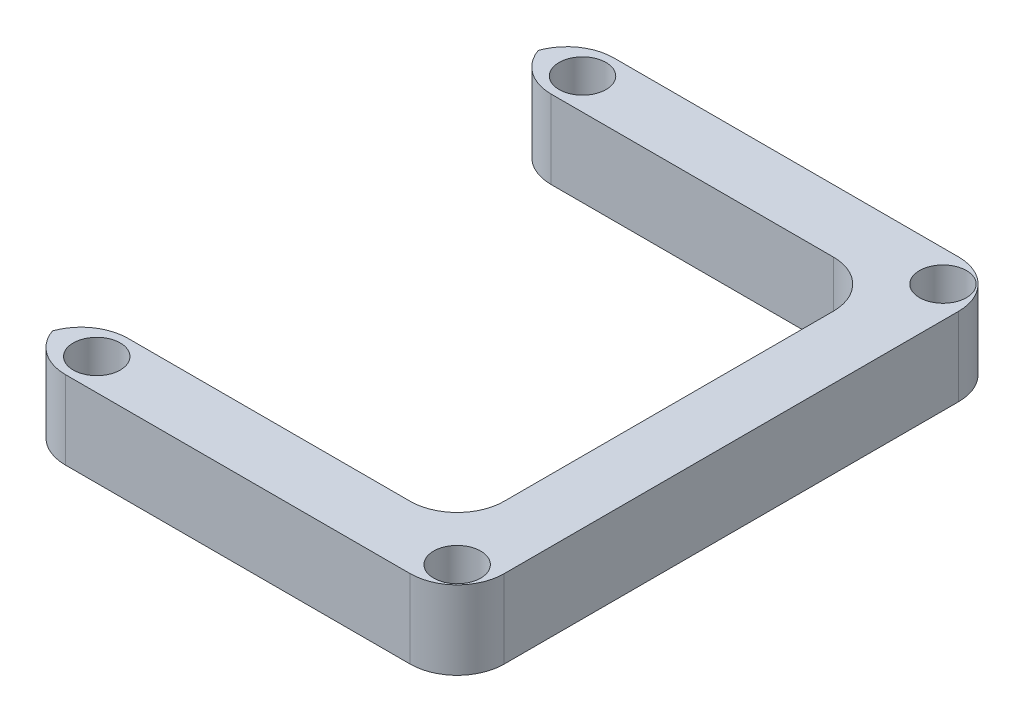
ISO-10303-21;
HEADER;
FILE_DESCRIPTION(('STEP AP214'),'2;1');
FILE_NAME('part.step','',(''),(''),'','','');
FILE_SCHEMA(('AUTOMOTIVE_DESIGN { 1 0 10303 214 1 1 1 1 }'));
ENDSEC;
DATA;
#1=APPLICATION_CONTEXT('core data for automotive mechanical design processes');
#2=APPLICATION_PROTOCOL_DEFINITION('international standard','automotive_design',2000,#1);
#3=PRODUCT_CONTEXT('',#1,'mechanical');
#4=PRODUCT('Part','Part','',(#3));
#5=PRODUCT_RELATED_PRODUCT_CATEGORY('part','',(#4));
#6=PRODUCT_DEFINITION_FORMATION('','',#4);
#7=PRODUCT_DEFINITION_CONTEXT('part definition',#1,'design');
#8=PRODUCT_DEFINITION('design','',#6,#7);
#9=PRODUCT_DEFINITION_SHAPE('','',#8);
#10=(LENGTH_UNIT() NAMED_UNIT(*) SI_UNIT(.MILLI.,.METRE.));
#11=(NAMED_UNIT(*) PLANE_ANGLE_UNIT() SI_UNIT($,.RADIAN.));
#12=(NAMED_UNIT(*) SI_UNIT($,.STERADIAN.) SOLID_ANGLE_UNIT());
#13=UNCERTAINTY_MEASURE_WITH_UNIT(LENGTH_MEASURE(1.E-05),#10,'distance_accuracy_value','');
#14=(GEOMETRIC_REPRESENTATION_CONTEXT(3) GLOBAL_UNCERTAINTY_ASSIGNED_CONTEXT((#13)) GLOBAL_UNIT_ASSIGNED_CONTEXT((#10,
#11,#12)) REPRESENTATION_CONTEXT('',''));
#15=CARTESIAN_POINT('',(0.,0.,0.));
#16=DIRECTION('',(0.,0.,1.));
#17=DIRECTION('',(1.,0.,0.));
#18=AXIS2_PLACEMENT_3D('',#15,#16,#17);
#19=CARTESIAN_POINT('',(0.,5.,-31.));
#20=DIRECTION('',(0.,0.,1.));
#21=DIRECTION('',(1.,0.,0.));
#22=AXIS2_PLACEMENT_3D('',#19,#20,#21);
#23=PLANE('',#22);
#24=DIRECTION('',(-1.,0.,0.));
#25=VECTOR('',#24,1.);
#26=CARTESIAN_POINT('',(0.,5.,-31.));
#27=LINE('',#26,#25);
#28=CARTESIAN_POINT('',(21.,5.,-31.));
#29=VERTEX_POINT('',#28);
#30=CARTESIAN_POINT('',(3.,5.,-31.));
#31=VERTEX_POINT('',#30);
#32=EDGE_CURVE('E302',#29,#31,#27,.T.);
#33=ORIENTED_EDGE('',*,*,#32,.T.);
#34=DIRECTION('',(0.,-1.,0.));
#35=VECTOR('',#34,1.);
#36=CARTESIAN_POINT('',(3.,5.,-31.));
#37=LINE('',#36,#35);
#38=CARTESIAN_POINT('',(3.,0.,-31.));
#39=VERTEX_POINT('',#38);
#40=EDGE_CURVE('E196',#31,#39,#37,.T.);
#41=ORIENTED_EDGE('',*,*,#40,.T.);
#42=DIRECTION('',(-1.,0.,0.));
#43=VECTOR('',#42,1.);
#44=CARTESIAN_POINT('',(0.,0.,-31.));
#45=LINE('',#44,#43);
#46=CARTESIAN_POINT('',(21.,0.,-31.));
#47=VERTEX_POINT('',#46);
#48=EDGE_CURVE('E259',#47,#39,#45,.T.);
#49=ORIENTED_EDGE('',*,*,#48,.F.);
#50=DIRECTION('',(0.,-1.,0.));
#51=VECTOR('',#50,1.);
#52=CARTESIAN_POINT('',(21.,5.,-31.));
#53=LINE('',#52,#51);
#54=EDGE_CURVE('E194',#47,#29,#53,.F.);
#55=ORIENTED_EDGE('',*,*,#54,.T.);
#56=EDGE_LOOP('',(#33,#41,#49,#55));
#57=FACE_BOUND('',#56,.T.);
#58=ADVANCED_FACE('F38',(#57),#23,.T.);
#59=CARTESIAN_POINT('',(24.,5.,0.));
#60=DIRECTION('',(-1.,0.,0.));
#61=DIRECTION('',(0.,0.,1.));
#62=AXIS2_PLACEMENT_3D('',#59,#60,#61);
#63=PLANE('',#62);
#64=DIRECTION('',(0.,0.,-1.));
#65=VECTOR('',#64,1.);
#66=CARTESIAN_POINT('',(24.,5.,0.));
#67=LINE('',#66,#65);
#68=CARTESIAN_POINT('',(24.,5.,-7.));
#69=VERTEX_POINT('',#68);
#70=CARTESIAN_POINT('',(24.,5.,-28.));
#71=VERTEX_POINT('',#70);
#72=EDGE_CURVE('E247',#69,#71,#67,.T.);
#73=ORIENTED_EDGE('',*,*,#72,.T.);
#74=DIRECTION('',(0.,-1.,0.));
#75=VECTOR('',#74,1.);
#76=CARTESIAN_POINT('',(24.,0.,-28.));
#77=LINE('',#76,#75);
#78=CARTESIAN_POINT('',(24.,0.,-28.));
#79=VERTEX_POINT('',#78);
#80=EDGE_CURVE('E200',#71,#79,#77,.T.);
#81=ORIENTED_EDGE('',*,*,#80,.T.);
#82=DIRECTION('',(0.,0.,-1.));
#83=VECTOR('',#82,1.);
#84=CARTESIAN_POINT('',(24.,0.,0.));
#85=LINE('',#84,#83);
#86=CARTESIAN_POINT('',(24.,0.,-7.));
#87=VERTEX_POINT('',#86);
#88=EDGE_CURVE('E261',#87,#79,#85,.T.);
#89=ORIENTED_EDGE('',*,*,#88,.F.);
#90=DIRECTION('',(0.,-1.,0.));
#91=VECTOR('',#90,1.);
#92=CARTESIAN_POINT('',(24.,5.,-7.));
#93=LINE('',#92,#91);
#94=EDGE_CURVE('E198',#87,#69,#93,.F.);
#95=ORIENTED_EDGE('',*,*,#94,.T.);
#96=EDGE_LOOP('',(#73,#81,#89,#95));
#97=FACE_BOUND('',#96,.T.);
#98=ADVANCED_FACE('F290',(#97),#63,.T.);
#99=CARTESIAN_POINT('',(0.,5.,-4.));
#100=DIRECTION('',(0.,0.,-1.));
#101=DIRECTION('',(-1.,0.,0.));
#102=AXIS2_PLACEMENT_3D('',#99,#100,#101);
#103=PLANE('',#102);
#104=DIRECTION('',(1.,0.,0.));
#105=VECTOR('',#104,1.);
#106=CARTESIAN_POINT('',(0.,5.,-4.));
#107=LINE('',#106,#105);
#108=CARTESIAN_POINT('',(3.,5.,-4.));
#109=VERTEX_POINT('',#108);
#110=CARTESIAN_POINT('',(21.,5.,-4.));
#111=VERTEX_POINT('',#110);
#112=EDGE_CURVE('E243',#109,#111,#107,.T.);
#113=ORIENTED_EDGE('',*,*,#112,.T.);
#114=DIRECTION('',(0.,-1.,0.));
#115=VECTOR('',#114,1.);
#116=CARTESIAN_POINT('',(21.,0.,-4.));
#117=LINE('',#116,#115);
#118=CARTESIAN_POINT('',(21.,0.,-4.));
#119=VERTEX_POINT('',#118);
#120=EDGE_CURVE('E206',#111,#119,#117,.T.);
#121=ORIENTED_EDGE('',*,*,#120,.T.);
#122=DIRECTION('',(1.,0.,0.));
#123=VECTOR('',#122,1.);
#124=CARTESIAN_POINT('',(0.,0.,-4.));
#125=LINE('',#124,#123);
#126=CARTESIAN_POINT('',(3.,0.,-4.));
#127=VERTEX_POINT('',#126);
#128=EDGE_CURVE('E264',#127,#119,#125,.T.);
#129=ORIENTED_EDGE('',*,*,#128,.F.);
#130=DIRECTION('',(0.,-1.,0.));
#131=VECTOR('',#130,1.);
#132=CARTESIAN_POINT('',(3.,5.,-4.));
#133=LINE('',#132,#131);
#134=EDGE_CURVE('E203',#127,#109,#133,.F.);
#135=ORIENTED_EDGE('',*,*,#134,.T.);
#136=EDGE_LOOP('',(#113,#121,#129,#135));
#137=FACE_BOUND('',#136,.T.);
#138=ADVANCED_FACE('F281',(#137),#103,.T.);
#139=CARTESIAN_POINT('',(0.,5.,0.));
#140=DIRECTION('',(0.,0.,-1.));
#141=DIRECTION('',(-1.,0.,0.));
#142=AXIS2_PLACEMENT_3D('',#139,#140,#141);
#143=PLANE('',#142);
#144=DIRECTION('',(1.,0.,0.));
#145=VECTOR('',#144,1.);
#146=CARTESIAN_POINT('',(0.,5.,0.));
#147=LINE('',#146,#145);
#148=CARTESIAN_POINT('',(3.,5.,0.));
#149=VERTEX_POINT('',#148);
#150=CARTESIAN_POINT('',(25.,5.,0.));
#151=VERTEX_POINT('',#150);
#152=EDGE_CURVE('E236',#149,#151,#147,.T.);
#153=ORIENTED_EDGE('',*,*,#152,.F.);
#154=DIRECTION('',(0.,-1.,0.));
#155=VECTOR('',#154,1.);
#156=CARTESIAN_POINT('',(3.,0.,0.));
#157=LINE('',#156,#155);
#158=CARTESIAN_POINT('',(3.,0.,0.));
#159=VERTEX_POINT('',#158);
#160=EDGE_CURVE('E211',#149,#159,#157,.T.);
#161=ORIENTED_EDGE('',*,*,#160,.T.);
#162=DIRECTION('',(1.,0.,0.));
#163=VECTOR('',#162,1.);
#164=CARTESIAN_POINT('',(0.,0.,0.));
#165=LINE('',#164,#163);
#166=CARTESIAN_POINT('',(25.,0.,0.));
#167=VERTEX_POINT('',#166);
#168=EDGE_CURVE('E267',#159,#167,#165,.T.);
#169=ORIENTED_EDGE('',*,*,#168,.T.);
#170=DIRECTION('',(0.,-1.,0.));
#171=VECTOR('',#170,1.);
#172=CARTESIAN_POINT('',(25.,5.,0.));
#173=LINE('',#172,#171);
#174=EDGE_CURVE('E209',#167,#151,#173,.F.);
#175=ORIENTED_EDGE('',*,*,#174,.T.);
#176=EDGE_LOOP('',(#153,#161,#169,#175));
#177=FACE_BOUND('',#176,.T.);
#178=ADVANCED_FACE('F239',(#177),#143,.F.);
#179=CARTESIAN_POINT('',(28.,5.,0.));
#180=DIRECTION('',(-1.,0.,0.));
#181=DIRECTION('',(0.,0.,1.));
#182=AXIS2_PLACEMENT_3D('',#179,#180,#181);
#183=PLANE('',#182);
#184=DIRECTION('',(0.,0.,-1.));
#185=VECTOR('',#184,1.);
#186=CARTESIAN_POINT('',(28.,0.,0.));
#187=LINE('',#186,#185);
#188=CARTESIAN_POINT('',(28.,0.,-3.));
#189=VERTEX_POINT('',#188);
#190=CARTESIAN_POINT('',(28.,0.,-32.));
#191=VERTEX_POINT('',#190);
#192=EDGE_CURVE('E161',#189,#191,#187,.T.);
#193=ORIENTED_EDGE('',*,*,#192,.T.);
#194=DIRECTION('',(0.,-1.,0.));
#195=VECTOR('',#194,1.);
#196=CARTESIAN_POINT('',(28.,5.,-32.));
#197=LINE('',#196,#195);
#198=CARTESIAN_POINT('',(28.,5.,-32.));
#199=VERTEX_POINT('',#198);
#200=EDGE_CURVE('E182',#191,#199,#197,.F.);
#201=ORIENTED_EDGE('',*,*,#200,.T.);
#202=DIRECTION('',(0.,0.,-1.));
#203=VECTOR('',#202,1.);
#204=CARTESIAN_POINT('',(28.,5.,0.));
#205=LINE('',#204,#203);
#206=CARTESIAN_POINT('',(28.,5.,-3.));
#207=VERTEX_POINT('',#206);
#208=EDGE_CURVE('E168',#207,#199,#205,.T.);
#209=ORIENTED_EDGE('',*,*,#208,.F.);
#210=DIRECTION('',(0.,-1.,0.));
#211=VECTOR('',#210,1.);
#212=CARTESIAN_POINT('',(28.,5.,-3.));
#213=LINE('',#212,#211);
#214=EDGE_CURVE('E179',#207,#189,#213,.T.);
#215=ORIENTED_EDGE('',*,*,#214,.T.);
#216=EDGE_LOOP('',(#193,#201,#209,#215));
#217=FACE_BOUND('',#216,.T.);
#218=ADVANCED_FACE('F272',(#217),#183,.F.);
#219=CARTESIAN_POINT('',(3.,5.,-2.));
#220=DIRECTION('',(0.,-1.,0.));
#221=DIRECTION('',(0.,0.,-1.));
#222=AXIS2_PLACEMENT_3D('',#219,#220,#221);
#223=CYLINDRICAL_SURFACE('',#222,1.5);
#224=CARTESIAN_POINT('',(3.,5.,-2.));
#225=DIRECTION('',(0.,1.,0.));
#226=DIRECTION('',(0.,0.,1.));
#227=AXIS2_PLACEMENT_3D('',#224,#225,#226);
#228=CIRCLE('',#227,1.5);
#229=CARTESIAN_POINT('',(3.,5.,-0.5));
#230=VERTEX_POINT('',#229);
#231=EDGE_CURVE('E305',#230,#230,#228,.T.);
#232=ORIENTED_EDGE('',*,*,#231,.T.);
#233=EDGE_LOOP('',(#232));
#234=FACE_BOUND('',#233,.T.);
#235=CARTESIAN_POINT('',(3.,0.,-2.));
#236=DIRECTION('',(0.,1.,0.));
#237=DIRECTION('',(0.,0.,1.));
#238=AXIS2_PLACEMENT_3D('',#235,#236,#237);
#239=CIRCLE('',#238,1.5);
#240=CARTESIAN_POINT('',(3.,0.,-0.5));
#241=VERTEX_POINT('',#240);
#242=EDGE_CURVE('E256',#241,#241,#239,.T.);
#243=ORIENTED_EDGE('',*,*,#242,.F.);
#244=EDGE_LOOP('',(#243));
#245=FACE_BOUND('',#244,.T.);
#246=ADVANCED_FACE('F331',(#234,#245),#223,.F.);
#247=CARTESIAN_POINT('',(3.,5.,-33.));
#248=DIRECTION('',(0.,-1.,0.));
#249=DIRECTION('',(0.,0.,-1.));
#250=AXIS2_PLACEMENT_3D('',#247,#248,#249);
#251=CYLINDRICAL_SURFACE('',#250,1.5);
#252=CARTESIAN_POINT('',(3.,5.,-33.));
#253=DIRECTION('',(0.,1.,0.));
#254=DIRECTION('',(0.,0.,1.));
#255=AXIS2_PLACEMENT_3D('',#252,#253,#254);
#256=CIRCLE('',#255,1.5);
#257=CARTESIAN_POINT('',(3.,5.,-31.5));
#258=VERTEX_POINT('',#257);
#259=EDGE_CURVE('E308',#258,#258,#256,.T.);
#260=ORIENTED_EDGE('',*,*,#259,.T.);
#261=EDGE_LOOP('',(#260));
#262=FACE_BOUND('',#261,.T.);
#263=CARTESIAN_POINT('',(3.,0.,-33.));
#264=DIRECTION('',(0.,1.,0.));
#265=DIRECTION('',(0.,0.,1.));
#266=AXIS2_PLACEMENT_3D('',#263,#264,#265);
#267=CIRCLE('',#266,1.5);
#268=CARTESIAN_POINT('',(3.,0.,-31.5));
#269=VERTEX_POINT('',#268);
#270=EDGE_CURVE('E253',#269,#269,#267,.T.);
#271=ORIENTED_EDGE('',*,*,#270,.F.);
#272=EDGE_LOOP('',(#271));
#273=FACE_BOUND('',#272,.T.);
#274=ADVANCED_FACE('F334',(#262,#273),#251,.F.);
#275=CARTESIAN_POINT('',(26.,5.,-33.));
#276=DIRECTION('',(0.,-1.,0.));
#277=DIRECTION('',(0.,0.,-1.));
#278=AXIS2_PLACEMENT_3D('',#275,#276,#277);
#279=CYLINDRICAL_SURFACE('',#278,1.5);
#280=CARTESIAN_POINT('',(26.,5.,-33.));
#281=DIRECTION('',(0.,1.,0.));
#282=DIRECTION('',(0.,0.,1.));
#283=AXIS2_PLACEMENT_3D('',#280,#281,#282);
#284=CIRCLE('',#283,1.5);
#285=CARTESIAN_POINT('',(26.,5.,-31.5));
#286=VERTEX_POINT('',#285);
#287=EDGE_CURVE('E313',#286,#286,#284,.T.);
#288=ORIENTED_EDGE('',*,*,#287,.T.);
#289=EDGE_LOOP('',(#288));
#290=FACE_BOUND('',#289,.T.);
#291=CARTESIAN_POINT('',(26.,0.,-33.));
#292=DIRECTION('',(0.,1.,0.));
#293=DIRECTION('',(0.,0.,1.));
#294=AXIS2_PLACEMENT_3D('',#291,#292,#293);
#295=CIRCLE('',#294,1.5);
#296=CARTESIAN_POINT('',(26.,0.,-31.5));
#297=VERTEX_POINT('',#296);
#298=EDGE_CURVE('E220',#297,#297,#295,.T.);
#299=ORIENTED_EDGE('',*,*,#298,.F.);
#300=EDGE_LOOP('',(#299));
#301=FACE_BOUND('',#300,.T.);
#302=ADVANCED_FACE('F357',(#290,#301),#279,.F.);
#303=CARTESIAN_POINT('',(26.,5.,-2.));
#304=DIRECTION('',(0.,-1.,0.));
#305=DIRECTION('',(0.,0.,-1.));
#306=AXIS2_PLACEMENT_3D('',#303,#304,#305);
#307=CYLINDRICAL_SURFACE('',#306,1.5);
#308=CARTESIAN_POINT('',(26.,5.,-2.));
#309=DIRECTION('',(0.,1.,0.));
#310=DIRECTION('',(0.,0.,1.));
#311=AXIS2_PLACEMENT_3D('',#308,#309,#310);
#312=CIRCLE('',#311,1.5);
#313=CARTESIAN_POINT('',(26.,5.,-0.499999999999999));
#314=VERTEX_POINT('',#313);
#315=EDGE_CURVE('E160',#314,#314,#312,.T.);
#316=ORIENTED_EDGE('',*,*,#315,.T.);
#317=EDGE_LOOP('',(#316));
#318=FACE_BOUND('',#317,.T.);
#319=CARTESIAN_POINT('',(26.,0.,-2.));
#320=DIRECTION('',(0.,1.,0.));
#321=DIRECTION('',(0.,0.,1.));
#322=AXIS2_PLACEMENT_3D('',#319,#320,#321);
#323=CIRCLE('',#322,1.5);
#324=CARTESIAN_POINT('',(26.,0.,-0.499999999999999));
#325=VERTEX_POINT('',#324);
#326=EDGE_CURVE('E218',#325,#325,#323,.T.);
#327=ORIENTED_EDGE('',*,*,#326,.F.);
#328=EDGE_LOOP('',(#327));
#329=FACE_BOUND('',#328,.T.);
#330=ADVANCED_FACE('F319',(#318,#329),#307,.F.);
#331=CARTESIAN_POINT('',(0.,5.,-35.));
#332=DIRECTION('',(0.,0.,-1.));
#333=DIRECTION('',(-1.,0.,0.));
#334=AXIS2_PLACEMENT_3D('',#331,#332,#333);
#335=PLANE('',#334);
#336=DIRECTION('',(1.,0.,0.));
#337=VECTOR('',#336,1.);
#338=CARTESIAN_POINT('',(0.,5.,-35.));
#339=LINE('',#338,#337);
#340=CARTESIAN_POINT('',(3.,5.,-35.));
#341=VERTEX_POINT('',#340);
#342=CARTESIAN_POINT('',(25.,5.,-35.));
#343=VERTEX_POINT('',#342);
#344=EDGE_CURVE('E164',#341,#343,#339,.T.);
#345=ORIENTED_EDGE('',*,*,#344,.T.);
#346=DIRECTION('',(0.,-1.,0.));
#347=VECTOR('',#346,1.);
#348=CARTESIAN_POINT('',(25.,0.,-35.));
#349=LINE('',#348,#347);
#350=CARTESIAN_POINT('',(25.,0.,-35.));
#351=VERTEX_POINT('',#350);
#352=EDGE_CURVE('E159',#343,#351,#349,.T.);
#353=ORIENTED_EDGE('',*,*,#352,.T.);
#354=DIRECTION('',(1.,0.,0.));
#355=VECTOR('',#354,1.);
#356=CARTESIAN_POINT('',(0.,0.,-35.));
#357=LINE('',#356,#355);
#358=CARTESIAN_POINT('',(3.,0.,-35.));
#359=VERTEX_POINT('',#358);
#360=EDGE_CURVE('E142',#359,#351,#357,.T.);
#361=ORIENTED_EDGE('',*,*,#360,.F.);
#362=DIRECTION('',(0.,-1.,0.));
#363=VECTOR('',#362,1.);
#364=CARTESIAN_POINT('',(3.,5.,-35.));
#365=LINE('',#364,#363);
#366=EDGE_CURVE('E157',#359,#341,#365,.F.);
#367=ORIENTED_EDGE('',*,*,#366,.T.);
#368=EDGE_LOOP('',(#345,#353,#361,#367));
#369=FACE_BOUND('',#368,.T.);
#370=ADVANCED_FACE('F156',(#369),#335,.T.);
#371=CARTESIAN_POINT('',(0.,5.,0.));
#372=DIRECTION('',(0.,1.,0.));
#373=DIRECTION('',(0.,0.,1.));
#374=AXIS2_PLACEMENT_3D('',#371,#372,#373);
#375=PLANE('',#374);
#376=ORIENTED_EDGE('',*,*,#315,.F.);
#377=EDGE_LOOP('',(#376));
#378=FACE_BOUND('',#377,.T.);
#379=ORIENTED_EDGE('',*,*,#287,.F.);
#380=EDGE_LOOP('',(#379));
#381=FACE_BOUND('',#380,.T.);
#382=ORIENTED_EDGE('',*,*,#259,.F.);
#383=EDGE_LOOP('',(#382));
#384=FACE_BOUND('',#383,.T.);
#385=ORIENTED_EDGE('',*,*,#231,.F.);
#386=EDGE_LOOP('',(#385));
#387=FACE_BOUND('',#386,.T.);
#388=ORIENTED_EDGE('',*,*,#208,.T.);
#389=CARTESIAN_POINT('',(25.,5.,-32.));
#390=DIRECTION('',(0.,1.,0.));
#391=DIRECTION('',(0.,0.,1.));
#392=AXIS2_PLACEMENT_3D('',#389,#390,#391);
#393=CIRCLE('',#392,3.);
#394=EDGE_CURVE('E192',#199,#343,#393,.T.);
#395=ORIENTED_EDGE('',*,*,#394,.T.);
#396=ORIENTED_EDGE('',*,*,#344,.F.);
#397=CARTESIAN_POINT('',(3.,5.,-32.));
#398=DIRECTION('',(0.,1.,0.));
#399=DIRECTION('',(0.,0.,1.));
#400=AXIS2_PLACEMENT_3D('',#397,#398,#399);
#401=CIRCLE('',#400,3.);
#402=CARTESIAN_POINT('',(0.17157287525381,5.,-33.));
#403=VERTEX_POINT('',#402);
#404=EDGE_CURVE('E55',#341,#403,#401,.T.);
#405=ORIENTED_EDGE('',*,*,#404,.T.);
#406=CARTESIAN_POINT('',(3.,5.,-34.));
#407=DIRECTION('',(0.,1.,0.));
#408=DIRECTION('',(0.,0.,1.));
#409=AXIS2_PLACEMENT_3D('',#406,#407,#408);
#410=CIRCLE('',#409,3.);
#411=EDGE_CURVE('E189',#403,#31,#410,.T.);
#412=ORIENTED_EDGE('',*,*,#411,.T.);
#413=ORIENTED_EDGE('',*,*,#32,.F.);
#414=CARTESIAN_POINT('',(21.,5.,-28.));
#415=DIRECTION('',(0.,1.,0.));
#416=DIRECTION('',(0.,0.,1.));
#417=AXIS2_PLACEMENT_3D('',#414,#415,#416);
#418=CIRCLE('',#417,3.);
#419=EDGE_CURVE('E215',#29,#71,#418,.F.);
#420=ORIENTED_EDGE('',*,*,#419,.T.);
#421=ORIENTED_EDGE('',*,*,#72,.F.);
#422=CARTESIAN_POINT('',(21.,5.,-7.));
#423=DIRECTION('',(0.,1.,0.));
#424=DIRECTION('',(0.,0.,1.));
#425=AXIS2_PLACEMENT_3D('',#422,#423,#424);
#426=CIRCLE('',#425,3.);
#427=EDGE_CURVE('E11',#69,#111,#426,.F.);
#428=ORIENTED_EDGE('',*,*,#427,.T.);
#429=ORIENTED_EDGE('',*,*,#112,.F.);
#430=CARTESIAN_POINT('',(3.,5.,-1.));
#431=DIRECTION('',(0.,1.,0.));
#432=DIRECTION('',(0.,0.,1.));
#433=AXIS2_PLACEMENT_3D('',#430,#431,#432);
#434=CIRCLE('',#433,3.);
#435=CARTESIAN_POINT('',(0.17157287525381,5.,-2.));
#436=VERTEX_POINT('',#435);
#437=EDGE_CURVE('E62',#109,#436,#434,.T.);
#438=ORIENTED_EDGE('',*,*,#437,.T.);
#439=CARTESIAN_POINT('',(3.,5.,-3.));
#440=DIRECTION('',(0.,1.,0.));
#441=DIRECTION('',(0.,0.,1.));
#442=AXIS2_PLACEMENT_3D('',#439,#440,#441);
#443=CIRCLE('',#442,3.);
#444=EDGE_CURVE('E186',#436,#149,#443,.T.);
#445=ORIENTED_EDGE('',*,*,#444,.T.);
#446=ORIENTED_EDGE('',*,*,#152,.T.);
#447=CARTESIAN_POINT('',(25.,5.,-3.));
#448=DIRECTION('',(0.,1.,0.));
#449=DIRECTION('',(0.,0.,1.));
#450=AXIS2_PLACEMENT_3D('',#447,#448,#449);
#451=CIRCLE('',#450,3.);
#452=EDGE_CURVE('E184',#151,#207,#451,.T.);
#453=ORIENTED_EDGE('',*,*,#452,.T.);
#454=EDGE_LOOP('',(#388,#395,#396,#405,#412,#413,#420,#421,#428,#429,#438,#445,#446,#453));
#455=FACE_BOUND('',#454,.T.);
#456=ADVANCED_FACE('F235',(#378,#381,#384,#387,#455),#375,.T.);
#457=CARTESIAN_POINT('',(0.,0.,0.));
#458=DIRECTION('',(0.,1.,0.));
#459=DIRECTION('',(0.,0.,1.));
#460=AXIS2_PLACEMENT_3D('',#457,#458,#459);
#461=PLANE('',#460);
#462=ORIENTED_EDGE('',*,*,#326,.T.);
#463=EDGE_LOOP('',(#462));
#464=FACE_BOUND('',#463,.T.);
#465=ORIENTED_EDGE('',*,*,#298,.T.);
#466=EDGE_LOOP('',(#465));
#467=FACE_BOUND('',#466,.T.);
#468=ORIENTED_EDGE('',*,*,#270,.T.);
#469=EDGE_LOOP('',(#468));
#470=FACE_BOUND('',#469,.T.);
#471=ORIENTED_EDGE('',*,*,#242,.T.);
#472=EDGE_LOOP('',(#471));
#473=FACE_BOUND('',#472,.T.);
#474=ORIENTED_EDGE('',*,*,#360,.T.);
#475=CARTESIAN_POINT('',(25.,0.,-32.));
#476=DIRECTION('',(0.,1.,0.));
#477=DIRECTION('',(0.,0.,1.));
#478=AXIS2_PLACEMENT_3D('',#475,#476,#477);
#479=CIRCLE('',#478,3.);
#480=EDGE_CURVE('E150',#351,#191,#479,.F.);
#481=ORIENTED_EDGE('',*,*,#480,.T.);
#482=ORIENTED_EDGE('',*,*,#192,.F.);
#483=CARTESIAN_POINT('',(25.,0.,-3.));
#484=DIRECTION('',(0.,1.,0.));
#485=DIRECTION('',(0.,0.,1.));
#486=AXIS2_PLACEMENT_3D('',#483,#484,#485);
#487=CIRCLE('',#486,3.);
#488=EDGE_CURVE('E166',#189,#167,#487,.F.);
#489=ORIENTED_EDGE('',*,*,#488,.T.);
#490=ORIENTED_EDGE('',*,*,#168,.F.);
#491=CARTESIAN_POINT('',(3.,0.,-3.));
#492=DIRECTION('',(0.,1.,0.));
#493=DIRECTION('',(0.,0.,1.));
#494=AXIS2_PLACEMENT_3D('',#491,#492,#493);
#495=CIRCLE('',#494,3.);
#496=CARTESIAN_POINT('',(0.17157287525381,0.,-2.));
#497=VERTEX_POINT('',#496);
#498=EDGE_CURVE('E173',#159,#497,#495,.F.);
#499=ORIENTED_EDGE('',*,*,#498,.T.);
#500=CARTESIAN_POINT('',(3.,0.,-1.));
#501=DIRECTION('',(0.,1.,0.));
#502=DIRECTION('',(0.,0.,1.));
#503=AXIS2_PLACEMENT_3D('',#500,#501,#502);
#504=CIRCLE('',#503,3.);
#505=EDGE_CURVE('E175',#497,#127,#504,.F.);
#506=ORIENTED_EDGE('',*,*,#505,.T.);
#507=ORIENTED_EDGE('',*,*,#128,.T.);
#508=CARTESIAN_POINT('',(21.,0.,-7.));
#509=DIRECTION('',(0.,1.,0.));
#510=DIRECTION('',(0.,0.,1.));
#511=AXIS2_PLACEMENT_3D('',#508,#509,#510);
#512=CIRCLE('',#511,3.);
#513=EDGE_CURVE('E47',#119,#87,#512,.T.);
#514=ORIENTED_EDGE('',*,*,#513,.T.);
#515=ORIENTED_EDGE('',*,*,#88,.T.);
#516=CARTESIAN_POINT('',(21.,0.,-28.));
#517=DIRECTION('',(0.,1.,0.));
#518=DIRECTION('',(0.,0.,1.));
#519=AXIS2_PLACEMENT_3D('',#516,#517,#518);
#520=CIRCLE('',#519,3.);
#521=EDGE_CURVE('E213',#79,#47,#520,.T.);
#522=ORIENTED_EDGE('',*,*,#521,.T.);
#523=ORIENTED_EDGE('',*,*,#48,.T.);
#524=CARTESIAN_POINT('',(3.,0.,-34.));
#525=DIRECTION('',(0.,1.,0.));
#526=DIRECTION('',(0.,0.,1.));
#527=AXIS2_PLACEMENT_3D('',#524,#525,#526);
#528=CIRCLE('',#527,3.);
#529=CARTESIAN_POINT('',(0.17157287525381,0.,-33.));
#530=VERTEX_POINT('',#529);
#531=EDGE_CURVE('E145',#39,#530,#528,.F.);
#532=ORIENTED_EDGE('',*,*,#531,.T.);
#533=CARTESIAN_POINT('',(3.,0.,-32.));
#534=DIRECTION('',(0.,1.,0.));
#535=DIRECTION('',(0.,0.,1.));
#536=AXIS2_PLACEMENT_3D('',#533,#534,#535);
#537=CIRCLE('',#536,3.);
#538=EDGE_CURVE('E139',#530,#359,#537,.F.);
#539=ORIENTED_EDGE('',*,*,#538,.T.);
#540=EDGE_LOOP('',(#474,#481,#482,#489,#490,#499,#506,#507,#514,#515,#522,#523,#532,#539));
#541=FACE_BOUND('',#540,.T.);
#542=ADVANCED_FACE('F141',(#464,#467,#470,#473,#541),#461,.F.);
#543=CARTESIAN_POINT('',(25.,5.,-32.));
#544=DIRECTION('',(0.,1.,0.));
#545=DIRECTION('',(0.,0.,1.));
#546=AXIS2_PLACEMENT_3D('',#543,#544,#545);
#547=CYLINDRICAL_SURFACE('',#546,3.);
#548=ORIENTED_EDGE('',*,*,#394,.F.);
#549=ORIENTED_EDGE('',*,*,#200,.F.);
#550=ORIENTED_EDGE('',*,*,#480,.F.);
#551=ORIENTED_EDGE('',*,*,#352,.F.);
#552=EDGE_LOOP('',(#548,#549,#550,#551));
#553=FACE_BOUND('',#552,.T.);
#554=ADVANCED_FACE('F277',(#553),#547,.T.);
#555=CARTESIAN_POINT('',(3.,5.,-34.));
#556=DIRECTION('',(0.,-1.,0.));
#557=DIRECTION('',(0.,0.,-1.));
#558=AXIS2_PLACEMENT_3D('',#555,#556,#557);
#559=CYLINDRICAL_SURFACE('',#558,3.);
#560=ORIENTED_EDGE('',*,*,#40,.F.);
#561=ORIENTED_EDGE('',*,*,#411,.F.);
#562=DIRECTION('',(0.,-1.,0.));
#563=VECTOR('',#562,1.);
#564=CARTESIAN_POINT('',(0.17157287525381,2.5,-33.));
#565=LINE('',#564,#563);
#566=EDGE_CURVE('E217',#530,#403,#565,.F.);
#567=ORIENTED_EDGE('',*,*,#566,.F.);
#568=ORIENTED_EDGE('',*,*,#531,.F.);
#569=EDGE_LOOP('',(#560,#561,#567,#568));
#570=FACE_BOUND('',#569,.T.);
#571=ADVANCED_FACE('F304',(#570),#559,.T.);
#572=CARTESIAN_POINT('',(3.,5.,-32.));
#573=DIRECTION('',(0.,-1.,0.));
#574=DIRECTION('',(0.,0.,-1.));
#575=AXIS2_PLACEMENT_3D('',#572,#573,#574);
#576=CYLINDRICAL_SURFACE('',#575,3.);
#577=ORIENTED_EDGE('',*,*,#404,.F.);
#578=ORIENTED_EDGE('',*,*,#366,.F.);
#579=ORIENTED_EDGE('',*,*,#538,.F.);
#580=ORIENTED_EDGE('',*,*,#566,.T.);
#581=EDGE_LOOP('',(#577,#578,#579,#580));
#582=FACE_BOUND('',#581,.T.);
#583=ADVANCED_FACE('F163',(#582),#576,.T.);
#584=CARTESIAN_POINT('',(21.,5.,-28.));
#585=DIRECTION('',(0.,1.,0.));
#586=DIRECTION('',(0.,0.,1.));
#587=AXIS2_PLACEMENT_3D('',#584,#585,#586);
#588=CYLINDRICAL_SURFACE('',#587,3.);
#589=ORIENTED_EDGE('',*,*,#419,.F.);
#590=ORIENTED_EDGE('',*,*,#54,.F.);
#591=ORIENTED_EDGE('',*,*,#521,.F.);
#592=ORIENTED_EDGE('',*,*,#80,.F.);
#593=EDGE_LOOP('',(#589,#590,#591,#592));
#594=FACE_BOUND('',#593,.T.);
#595=ADVANCED_FACE('F295',(#594),#588,.F.);
#596=CARTESIAN_POINT('',(21.,5.,-7.));
#597=DIRECTION('',(0.,1.,0.));
#598=DIRECTION('',(0.,0.,1.));
#599=AXIS2_PLACEMENT_3D('',#596,#597,#598);
#600=CYLINDRICAL_SURFACE('',#599,3.);
#601=ORIENTED_EDGE('',*,*,#427,.F.);
#602=ORIENTED_EDGE('',*,*,#94,.F.);
#603=ORIENTED_EDGE('',*,*,#513,.F.);
#604=ORIENTED_EDGE('',*,*,#120,.F.);
#605=EDGE_LOOP('',(#601,#602,#603,#604));
#606=FACE_BOUND('',#605,.T.);
#607=ADVANCED_FACE('F285',(#606),#600,.F.);
#608=CARTESIAN_POINT('',(3.,5.,-3.));
#609=DIRECTION('',(0.,1.,0.));
#610=DIRECTION('',(0.,0.,1.));
#611=AXIS2_PLACEMENT_3D('',#608,#609,#610);
#612=CYLINDRICAL_SURFACE('',#611,3.);
#613=ORIENTED_EDGE('',*,*,#160,.F.);
#614=ORIENTED_EDGE('',*,*,#444,.F.);
#615=DIRECTION('',(0.,1.,0.));
#616=VECTOR('',#615,1.);
#617=CARTESIAN_POINT('',(0.17157287525381,2.5,-2.));
#618=LINE('',#617,#616);
#619=EDGE_CURVE('E42',#497,#436,#618,.T.);
#620=ORIENTED_EDGE('',*,*,#619,.F.);
#621=ORIENTED_EDGE('',*,*,#498,.F.);
#622=EDGE_LOOP('',(#613,#614,#620,#621));
#623=FACE_BOUND('',#622,.T.);
#624=ADVANCED_FACE('F231',(#623),#612,.T.);
#625=CARTESIAN_POINT('',(3.,5.,-1.));
#626=DIRECTION('',(0.,-1.,0.));
#627=DIRECTION('',(0.,0.,-1.));
#628=AXIS2_PLACEMENT_3D('',#625,#626,#627);
#629=CYLINDRICAL_SURFACE('',#628,3.);
#630=ORIENTED_EDGE('',*,*,#437,.F.);
#631=ORIENTED_EDGE('',*,*,#134,.F.);
#632=ORIENTED_EDGE('',*,*,#505,.F.);
#633=ORIENTED_EDGE('',*,*,#619,.T.);
#634=EDGE_LOOP('',(#630,#631,#632,#633));
#635=FACE_BOUND('',#634,.T.);
#636=ADVANCED_FACE('F226',(#635),#629,.T.);
#637=CARTESIAN_POINT('',(25.,5.,-3.));
#638=DIRECTION('',(0.,-1.,0.));
#639=DIRECTION('',(0.,0.,-1.));
#640=AXIS2_PLACEMENT_3D('',#637,#638,#639);
#641=CYLINDRICAL_SURFACE('',#640,3.);
#642=ORIENTED_EDGE('',*,*,#452,.F.);
#643=ORIENTED_EDGE('',*,*,#174,.F.);
#644=ORIENTED_EDGE('',*,*,#488,.F.);
#645=ORIENTED_EDGE('',*,*,#214,.F.);
#646=EDGE_LOOP('',(#642,#643,#644,#645));
#647=FACE_BOUND('',#646,.T.);
#648=ADVANCED_FACE('F40',(#647),#641,.T.);
#649=CLOSED_SHELL('',(#58,#98,#138,#178,#218,#246,#274,#302,#330,#370,#456,#542,#554,#571,#583,
#595,#607,#624,#636,#648));
#650=MANIFOLD_SOLID_BREP('B2',#649);
#651=ADVANCED_BREP_SHAPE_REPRESENTATION('',(#18,#650),#14);
#652=SHAPE_DEFINITION_REPRESENTATION(#9,#651);
ENDSEC;
END-ISO-10303-21;
